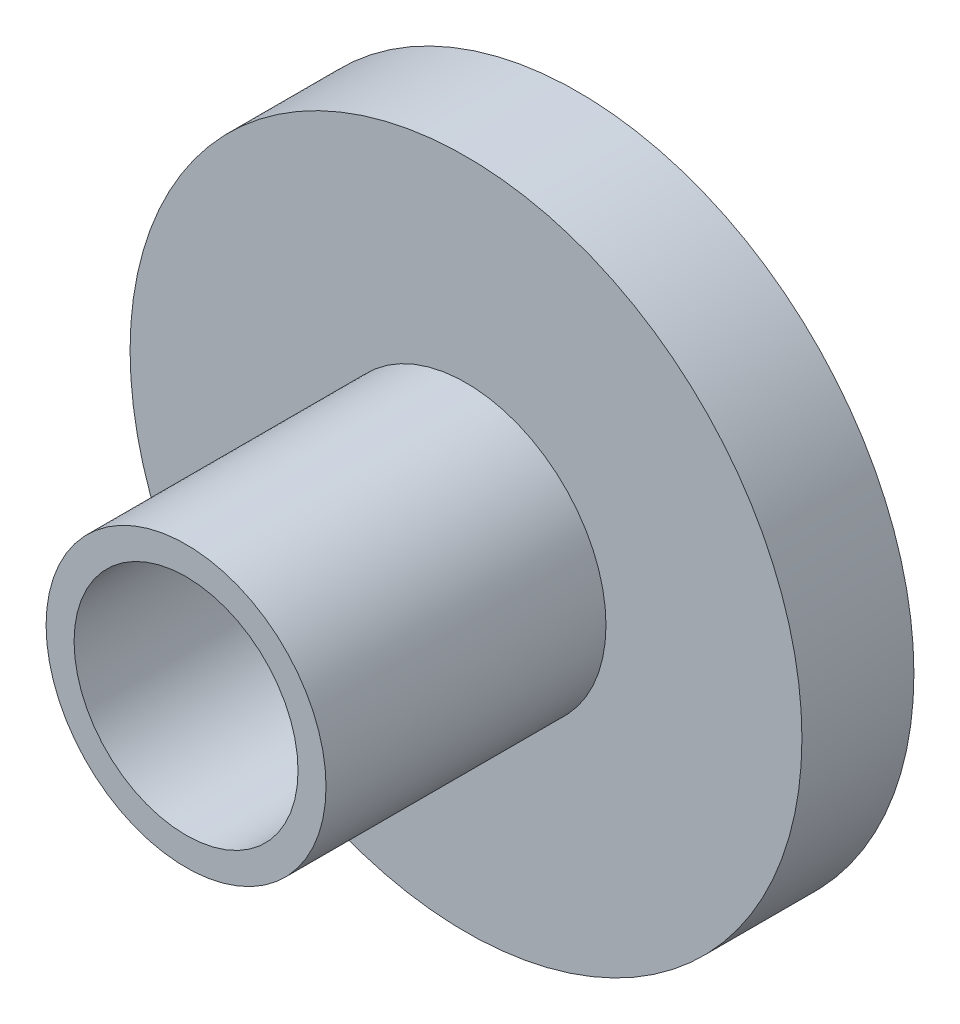
ISO-10303-21;
HEADER;
FILE_DESCRIPTION(('STEP AP214'),'2;1');
FILE_NAME('part.step','',(''),(''),'','','');
FILE_SCHEMA(('AUTOMOTIVE_DESIGN { 1 0 10303 214 1 1 1 1 }'));
ENDSEC;
DATA;
#1=APPLICATION_CONTEXT('core data for automotive mechanical design processes');
#2=APPLICATION_PROTOCOL_DEFINITION('international standard','automotive_design',2000,#1);
#3=PRODUCT_CONTEXT('',#1,'mechanical');
#4=PRODUCT('Part','Part','',(#3));
#5=PRODUCT_RELATED_PRODUCT_CATEGORY('part','',(#4));
#6=PRODUCT_DEFINITION_FORMATION('','',#4);
#7=PRODUCT_DEFINITION_CONTEXT('part definition',#1,'design');
#8=PRODUCT_DEFINITION('design','',#6,#7);
#9=PRODUCT_DEFINITION_SHAPE('','',#8);
#10=(LENGTH_UNIT() NAMED_UNIT(*) SI_UNIT(.MILLI.,.METRE.));
#11=(NAMED_UNIT(*) PLANE_ANGLE_UNIT() SI_UNIT($,.RADIAN.));
#12=(NAMED_UNIT(*) SI_UNIT($,.STERADIAN.) SOLID_ANGLE_UNIT());
#13=UNCERTAINTY_MEASURE_WITH_UNIT(LENGTH_MEASURE(1.E-05),#10,'distance_accuracy_value','');
#14=(GEOMETRIC_REPRESENTATION_CONTEXT(3) GLOBAL_UNCERTAINTY_ASSIGNED_CONTEXT((#13)) GLOBAL_UNIT_ASSIGNED_CONTEXT((#10,
#11,#12)) REPRESENTATION_CONTEXT('',''));
#15=CARTESIAN_POINT('',(0.,0.,0.));
#16=DIRECTION('',(0.,0.,1.));
#17=DIRECTION('',(1.,0.,0.));
#18=AXIS2_PLACEMENT_3D('',#15,#16,#17);
#19=CARTESIAN_POINT('',(0.,0.,2.));
#20=DIRECTION('',(0.,0.,-1.));
#21=DIRECTION('',(-1.,0.,0.));
#22=AXIS2_PLACEMENT_3D('',#19,#20,#21);
#23=CYLINDRICAL_SURFACE('',#22,6.);
#24=CARTESIAN_POINT('',(0.,0.,2.));
#25=DIRECTION('',(0.,0.,1.));
#26=DIRECTION('',(1.,0.,0.));
#27=AXIS2_PLACEMENT_3D('',#24,#25,#26);
#28=CIRCLE('',#27,6.);
#29=CARTESIAN_POINT('',(6.,0.,2.));
#30=VERTEX_POINT('',#29);
#31=EDGE_CURVE('E44',#30,#30,#28,.T.);
#32=ORIENTED_EDGE('',*,*,#31,.F.);
#33=EDGE_LOOP('',(#32));
#34=FACE_BOUND('',#33,.T.);
#35=CARTESIAN_POINT('',(0.,0.,0.));
#36=DIRECTION('',(0.,0.,1.));
#37=DIRECTION('',(1.,0.,0.));
#38=AXIS2_PLACEMENT_3D('',#35,#36,#37);
#39=CIRCLE('',#38,6.);
#40=CARTESIAN_POINT('',(6.,0.,0.));
#41=VERTEX_POINT('',#40);
#42=EDGE_CURVE('E49',#41,#41,#39,.T.);
#43=ORIENTED_EDGE('',*,*,#42,.T.);
#44=EDGE_LOOP('',(#43));
#45=FACE_BOUND('',#44,.T.);
#46=ADVANCED_FACE('F37',(#34,#45),#23,.T.);
#47=CARTESIAN_POINT('',(0.,0.,2.));
#48=DIRECTION('',(0.,0.,1.));
#49=DIRECTION('',(1.,0.,0.));
#50=AXIS2_PLACEMENT_3D('',#47,#48,#49);
#51=PLANE('',#50);
#52=CARTESIAN_POINT('',(0.,0.,2.));
#53=DIRECTION('',(0.,0.,1.));
#54=DIRECTION('',(1.,0.,0.));
#55=AXIS2_PLACEMENT_3D('',#52,#53,#54);
#56=CIRCLE('',#55,2.5);
#57=CARTESIAN_POINT('',(2.5,0.,2.));
#58=VERTEX_POINT('',#57);
#59=EDGE_CURVE('E57',#58,#58,#56,.T.);
#60=ORIENTED_EDGE('',*,*,#59,.F.);
#61=EDGE_LOOP('',(#60));
#62=FACE_BOUND('',#61,.T.);
#63=ORIENTED_EDGE('',*,*,#31,.T.);
#64=EDGE_LOOP('',(#63));
#65=FACE_BOUND('',#64,.T.);
#66=ADVANCED_FACE('F83',(#62,#65),#51,.T.);
#67=CARTESIAN_POINT('',(0.,0.,0.));
#68=DIRECTION('',(0.,0.,1.));
#69=DIRECTION('',(1.,0.,0.));
#70=AXIS2_PLACEMENT_3D('',#67,#68,#69);
#71=PLANE('',#70);
#72=ORIENTED_EDGE('',*,*,#42,.F.);
#73=EDGE_LOOP('',(#72));
#74=FACE_BOUND('',#73,.T.);
#75=ADVANCED_FACE('F74',(#74),#71,.F.);
#76=CARTESIAN_POINT('',(0.,0.,7.));
#77=DIRECTION('',(0.,0.,1.));
#78=DIRECTION('',(1.,0.,0.));
#79=AXIS2_PLACEMENT_3D('',#76,#77,#78);
#80=PLANE('',#79);
#81=CARTESIAN_POINT('',(0.,0.,7.));
#82=DIRECTION('',(0.,0.,1.));
#83=DIRECTION('',(1.,0.,0.));
#84=AXIS2_PLACEMENT_3D('',#81,#82,#83);
#85=CIRCLE('',#84,2.5);
#86=CARTESIAN_POINT('',(2.5,0.,7.));
#87=VERTEX_POINT('',#86);
#88=EDGE_CURVE('E55',#87,#87,#85,.T.);
#89=ORIENTED_EDGE('',*,*,#88,.T.);
#90=EDGE_LOOP('',(#89));
#91=FACE_BOUND('',#90,.T.);
#92=CARTESIAN_POINT('',(0.,0.,7.));
#93=DIRECTION('',(0.,0.,1.));
#94=DIRECTION('',(1.,0.,0.));
#95=AXIS2_PLACEMENT_3D('',#92,#93,#94);
#96=CIRCLE('',#95,2.);
#97=CARTESIAN_POINT('',(2.,0.,7.));
#98=VERTEX_POINT('',#97);
#99=EDGE_CURVE('E61',#98,#98,#96,.T.);
#100=ORIENTED_EDGE('',*,*,#99,.F.);
#101=EDGE_LOOP('',(#100));
#102=FACE_BOUND('',#101,.T.);
#103=ADVANCED_FACE('F71',(#91,#102),#80,.T.);
#104=CARTESIAN_POINT('',(0.,0.,7.));
#105=DIRECTION('',(0.,0.,-1.));
#106=DIRECTION('',(-1.,0.,0.));
#107=AXIS2_PLACEMENT_3D('',#104,#105,#106);
#108=CYLINDRICAL_SURFACE('',#107,2.5);
#109=ORIENTED_EDGE('',*,*,#88,.F.);
#110=EDGE_LOOP('',(#109));
#111=FACE_BOUND('',#110,.T.);
#112=ORIENTED_EDGE('',*,*,#59,.T.);
#113=EDGE_LOOP('',(#112));
#114=FACE_BOUND('',#113,.T.);
#115=ADVANCED_FACE('F73',(#111,#114),#108,.T.);
#116=CARTESIAN_POINT('',(0.,0.,7.));
#117=DIRECTION('',(0.,0.,-1.));
#118=DIRECTION('',(-1.,0.,0.));
#119=AXIS2_PLACEMENT_3D('',#116,#117,#118);
#120=CYLINDRICAL_SURFACE('',#119,2.);
#121=ORIENTED_EDGE('',*,*,#99,.T.);
#122=EDGE_LOOP('',(#121));
#123=FACE_BOUND('',#122,.T.);
#124=CARTESIAN_POINT('',(0.,0.,2.));
#125=DIRECTION('',(0.,0.,1.));
#126=DIRECTION('',(1.,0.,0.));
#127=AXIS2_PLACEMENT_3D('',#124,#125,#126);
#128=CIRCLE('',#127,2.);
#129=CARTESIAN_POINT('',(2.,0.,2.));
#130=VERTEX_POINT('',#129);
#131=EDGE_CURVE('E10',#130,#130,#128,.F.);
#132=ORIENTED_EDGE('',*,*,#131,.T.);
#133=EDGE_LOOP('',(#132));
#134=FACE_BOUND('',#133,.T.);
#135=ADVANCED_FACE('F69',(#123,#134),#120,.F.);
#136=ORIENTED_EDGE('',*,*,#131,.F.);
#137=EDGE_LOOP('',(#136));
#138=FACE_BOUND('',#137,.T.);
#139=ADVANCED_FACE('F93',(#138),#51,.T.);
#140=CLOSED_SHELL('',(#46,#66,#75,#103,#115,#135,#139));
#141=MANIFOLD_SOLID_BREP('B2',#140);
#142=ADVANCED_BREP_SHAPE_REPRESENTATION('',(#18,#141),#14);
#143=SHAPE_DEFINITION_REPRESENTATION(#9,#142);
ENDSEC;
END-ISO-10303-21;
